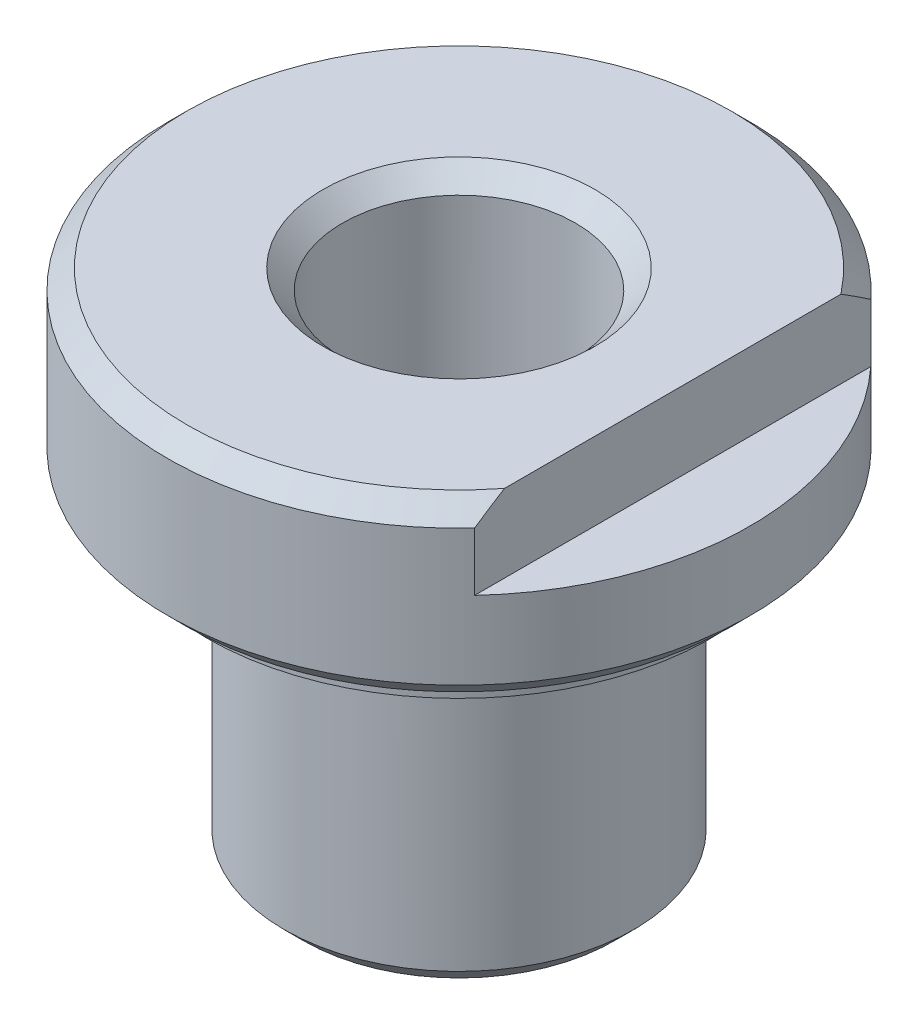
ISO-10303-21;
HEADER;
FILE_DESCRIPTION(('STEP AP214'),'2;1');
FILE_NAME('part.step','',(''),(''),'','','');
FILE_SCHEMA(('AUTOMOTIVE_DESIGN { 1 0 10303 214 1 1 1 1 }'));
ENDSEC;
DATA;
#1=APPLICATION_CONTEXT('core data for automotive mechanical design processes');
#2=APPLICATION_PROTOCOL_DEFINITION('international standard','automotive_design',2000,#1);
#3=PRODUCT_CONTEXT('',#1,'mechanical');
#4=PRODUCT('Part','Part','',(#3));
#5=PRODUCT_RELATED_PRODUCT_CATEGORY('part','',(#4));
#6=PRODUCT_DEFINITION_FORMATION('','',#4);
#7=PRODUCT_DEFINITION_CONTEXT('part definition',#1,'design');
#8=PRODUCT_DEFINITION('design','',#6,#7);
#9=PRODUCT_DEFINITION_SHAPE('','',#8);
#10=(LENGTH_UNIT() NAMED_UNIT(*) SI_UNIT(.MILLI.,.METRE.));
#11=(NAMED_UNIT(*) PLANE_ANGLE_UNIT() SI_UNIT($,.RADIAN.));
#12=(NAMED_UNIT(*) SI_UNIT($,.STERADIAN.) SOLID_ANGLE_UNIT());
#13=UNCERTAINTY_MEASURE_WITH_UNIT(LENGTH_MEASURE(1.E-05),#10,'distance_accuracy_value','');
#14=(GEOMETRIC_REPRESENTATION_CONTEXT(3) GLOBAL_UNCERTAINTY_ASSIGNED_CONTEXT((#13)) GLOBAL_UNIT_ASSIGNED_CONTEXT((#10,
#11,#12)) REPRESENTATION_CONTEXT('',''));
#15=CARTESIAN_POINT('',(0.,0.,0.));
#16=DIRECTION('',(0.,0.,1.));
#17=DIRECTION('',(1.,0.,0.));
#18=AXIS2_PLACEMENT_3D('',#15,#16,#17);
#19=CARTESIAN_POINT('',(0.,26.,0.));
#20=DIRECTION('',(0.,1.,0.));
#21=DIRECTION('',(0.,0.,1.));
#22=AXIS2_PLACEMENT_3D('',#19,#20,#21);
#23=CYLINDRICAL_SURFACE('',#22,8.);
#24=CARTESIAN_POINT('',(0.,16.5,0.));
#25=DIRECTION('',(0.,1.,0.));
#26=DIRECTION('',(0.,0.,1.));
#27=AXIS2_PLACEMENT_3D('',#24,#25,#26);
#28=CIRCLE('',#27,8.);
#29=CARTESIAN_POINT('',(0.,16.5,8.));
#30=VERTEX_POINT('',#29);
#31=EDGE_CURVE('E85',#30,#30,#28,.T.);
#32=ORIENTED_EDGE('',*,*,#31,.F.);
#33=EDGE_LOOP('',(#32));
#34=FACE_BOUND('',#33,.T.);
#35=CARTESIAN_POINT('',(0.,15.,0.));
#36=DIRECTION('',(0.,1.,0.));
#37=DIRECTION('',(0.,0.,1.));
#38=AXIS2_PLACEMENT_3D('',#35,#36,#37);
#39=CIRCLE('',#38,8.);
#40=CARTESIAN_POINT('',(0.,15.,8.));
#41=VERTEX_POINT('',#40);
#42=EDGE_CURVE('E91',#41,#41,#39,.T.);
#43=ORIENTED_EDGE('',*,*,#42,.T.);
#44=EDGE_LOOP('',(#43));
#45=FACE_BOUND('',#44,.T.);
#46=ADVANCED_FACE('F36',(#34,#45),#23,.T.);
#47=CARTESIAN_POINT('',(0.,16.5,0.));
#48=DIRECTION('',(0.,1.,0.));
#49=DIRECTION('',(0.,0.,1.));
#50=AXIS2_PLACEMENT_3D('',#47,#48,#49);
#51=PLANE('',#50);
#52=CARTESIAN_POINT('',(0.,16.5,0.));
#53=DIRECTION('',(0.,1.,0.));
#54=DIRECTION('',(0.,0.,1.));
#55=AXIS2_PLACEMENT_3D('',#52,#53,#54);
#56=CIRCLE('',#55,10.);
#57=CARTESIAN_POINT('',(0.,16.5,10.));
#58=VERTEX_POINT('',#57);
#59=EDGE_CURVE('E103',#58,#58,#56,.T.);
#60=ORIENTED_EDGE('',*,*,#59,.F.);
#61=EDGE_LOOP('',(#60));
#62=FACE_BOUND('',#61,.T.);
#63=ORIENTED_EDGE('',*,*,#31,.T.);
#64=EDGE_LOOP('',(#63));
#65=FACE_BOUND('',#64,.T.);
#66=ADVANCED_FACE('F157',(#62,#65),#51,.F.);
#67=CARTESIAN_POINT('',(0.,15.,0.));
#68=DIRECTION('',(0.,-1.,0.));
#69=DIRECTION('',(0.,0.,-1.));
#70=AXIS2_PLACEMENT_3D('',#67,#68,#69);
#71=PLANE('',#70);
#72=CARTESIAN_POINT('',(0.,15.,0.));
#73=DIRECTION('',(0.,-1.,0.));
#74=DIRECTION('',(0.,0.,-1.));
#75=AXIS2_PLACEMENT_3D('',#72,#73,#74);
#76=CIRCLE('',#75,8.5);
#77=CARTESIAN_POINT('',(0.,15.,-8.5));
#78=VERTEX_POINT('',#77);
#79=EDGE_CURVE('E223',#78,#78,#76,.F.);
#80=ORIENTED_EDGE('',*,*,#79,.T.);
#81=EDGE_LOOP('',(#80));
#82=FACE_BOUND('',#81,.T.);
#83=ORIENTED_EDGE('',*,*,#42,.F.);
#84=EDGE_LOOP('',(#83));
#85=FACE_BOUND('',#84,.T.);
#86=ADVANCED_FACE('F159',(#82,#85),#71,.F.);
#87=CARTESIAN_POINT('',(0.,26.,0.));
#88=DIRECTION('',(0.,1.,0.));
#89=DIRECTION('',(0.,0.,1.));
#90=AXIS2_PLACEMENT_3D('',#87,#88,#89);
#91=CYLINDRICAL_SURFACE('',#90,9.);
#92=CARTESIAN_POINT('',(0.,14.5,0.));
#93=DIRECTION('',(0.,-1.,0.));
#94=DIRECTION('',(0.,0.,-1.));
#95=AXIS2_PLACEMENT_3D('',#92,#93,#94);
#96=CIRCLE('',#95,9.);
#97=CARTESIAN_POINT('',(0.,14.5,-9.));
#98=VERTEX_POINT('',#97);
#99=EDGE_CURVE('E225',#98,#98,#96,.T.);
#100=ORIENTED_EDGE('',*,*,#99,.T.);
#101=EDGE_LOOP('',(#100));
#102=FACE_BOUND('',#101,.T.);
#103=CARTESIAN_POINT('',(0.,1.00000000000001,0.));
#104=DIRECTION('',(0.,1.,0.));
#105=DIRECTION('',(0.,0.,1.));
#106=AXIS2_PLACEMENT_3D('',#103,#104,#105);
#107=CIRCLE('',#106,9.);
#108=CARTESIAN_POINT('',(0.,1.00000000000001,9.));
#109=VERTEX_POINT('',#108);
#110=EDGE_CURVE('E115',#109,#109,#107,.T.);
#111=ORIENTED_EDGE('',*,*,#110,.T.);
#112=EDGE_LOOP('',(#111));
#113=FACE_BOUND('',#112,.T.);
#114=ADVANCED_FACE('F162',(#102,#113),#91,.T.);
#115=CARTESIAN_POINT('',(0.,0.,0.));
#116=DIRECTION('',(0.,1.,0.));
#117=DIRECTION('',(0.,0.,1.));
#118=AXIS2_PLACEMENT_3D('',#115,#116,#117);
#119=PLANE('',#118);
#120=CARTESIAN_POINT('',(0.,0.,0.));
#121=DIRECTION('',(0.,1.,0.));
#122=DIRECTION('',(0.,0.,1.));
#123=AXIS2_PLACEMENT_3D('',#120,#121,#122);
#124=CIRCLE('',#123,6.5);
#125=CARTESIAN_POINT('',(0.,0.,6.5));
#126=VERTEX_POINT('',#125);
#127=EDGE_CURVE('E11',#126,#126,#124,.T.);
#128=ORIENTED_EDGE('',*,*,#127,.T.);
#129=EDGE_LOOP('',(#128));
#130=FACE_BOUND('',#129,.T.);
#131=CARTESIAN_POINT('',(0.,0.,0.));
#132=DIRECTION('',(0.,1.,0.));
#133=DIRECTION('',(0.,0.,1.));
#134=AXIS2_PLACEMENT_3D('',#131,#132,#133);
#135=CIRCLE('',#134,7.99999999999998);
#136=CARTESIAN_POINT('',(0.,0.,7.99999999999998));
#137=VERTEX_POINT('',#136);
#138=EDGE_CURVE('E118',#137,#137,#135,.F.);
#139=ORIENTED_EDGE('',*,*,#138,.T.);
#140=EDGE_LOOP('',(#139));
#141=FACE_BOUND('',#140,.T.);
#142=ADVANCED_FACE('F154',(#130,#141),#119,.F.);
#143=CARTESIAN_POINT('',(0.,26.,0.));
#144=DIRECTION('',(0.,1.,0.));
#145=DIRECTION('',(0.,0.,1.));
#146=AXIS2_PLACEMENT_3D('',#143,#144,#145);
#147=CYLINDRICAL_SURFACE('',#146,15.);
#148=CARTESIAN_POINT('',(0.,18.,0.));
#149=DIRECTION('',(0.,-1.,0.));
#150=DIRECTION('',(0.,0.,-1.));
#151=AXIS2_PLACEMENT_3D('',#148,#149,#150);
#152=CIRCLE('',#151,15.);
#153=CARTESIAN_POINT('',(0.,18.,-15.));
#154=VERTEX_POINT('',#153);
#155=EDGE_CURVE('E122',#154,#154,#152,.F.);
#156=ORIENTED_EDGE('',*,*,#155,.T.);
#157=EDGE_LOOP('',(#156));
#158=FACE_BOUND('',#157,.T.);
#159=DIRECTION('',(0.,1.,0.));
#160=VECTOR('',#159,1.);
#161=CARTESIAN_POINT('',(11.,22.,10.1980390271856));
#162=LINE('',#161,#160);
#163=CARTESIAN_POINT('',(11.,22.,10.1980390271856));
#164=VERTEX_POINT('',#163);
#165=CARTESIAN_POINT('',(11.,25.,10.1980390271856));
#166=VERTEX_POINT('',#165);
#167=EDGE_CURVE('E81',#164,#166,#162,.T.);
#168=ORIENTED_EDGE('',*,*,#167,.T.);
#169=CARTESIAN_POINT('',(0.,25.,0.));
#170=DIRECTION('',(0.,-1.,0.));
#171=DIRECTION('',(0.,0.,-1.));
#172=AXIS2_PLACEMENT_3D('',#169,#170,#171);
#173=CIRCLE('',#172,15.);
#174=CARTESIAN_POINT('',(11.,25.,-10.1980390271856));
#175=VERTEX_POINT('',#174);
#176=EDGE_CURVE('E51',#166,#175,#173,.T.);
#177=ORIENTED_EDGE('',*,*,#176,.T.);
#178=DIRECTION('',(0.,1.,0.));
#179=VECTOR('',#178,1.);
#180=CARTESIAN_POINT('',(11.,22.,-10.1980390271856));
#181=LINE('',#180,#179);
#182=CARTESIAN_POINT('',(11.,22.,-10.1980390271856));
#183=VERTEX_POINT('',#182);
#184=EDGE_CURVE('E79',#183,#175,#181,.T.);
#185=ORIENTED_EDGE('',*,*,#184,.F.);
#186=CARTESIAN_POINT('',(0.,22.,0.));
#187=DIRECTION('',(0.,1.,0.));
#188=DIRECTION('',(0.,0.,1.));
#189=AXIS2_PLACEMENT_3D('',#186,#187,#188);
#190=CIRCLE('',#189,15.);
#191=EDGE_CURVE('E72',#164,#183,#190,.T.);
#192=ORIENTED_EDGE('',*,*,#191,.F.);
#193=EDGE_LOOP('',(#168,#177,#185,#192));
#194=FACE_BOUND('',#193,.T.);
#195=ADVANCED_FACE('F83',(#158,#194),#147,.T.);
#196=CARTESIAN_POINT('',(0.,26.,0.));
#197=DIRECTION('',(0.,-1.,0.));
#198=DIRECTION('',(0.,0.,-1.));
#199=AXIS2_PLACEMENT_3D('',#196,#197,#198);
#200=PLANE('',#199);
#201=CARTESIAN_POINT('',(0.,26.,0.));
#202=DIRECTION('',(0.,-1.,0.));
#203=DIRECTION('',(0.,0.,-1.));
#204=AXIS2_PLACEMENT_3D('',#201,#202,#203);
#205=CIRCLE('',#204,7.00000000000001);
#206=CARTESIAN_POINT('',(0.,26.,-7.00000000000001));
#207=VERTEX_POINT('',#206);
#208=EDGE_CURVE('E109',#207,#207,#205,.T.);
#209=ORIENTED_EDGE('',*,*,#208,.T.);
#210=EDGE_LOOP('',(#209));
#211=FACE_BOUND('',#210,.T.);
#212=DIRECTION('',(0.,0.,1.));
#213=VECTOR('',#212,1.);
#214=CARTESIAN_POINT('',(11.,26.,-10.1980390271856));
#215=LINE('',#214,#213);
#216=CARTESIAN_POINT('',(11.,26.,-8.66025403784439));
#217=VERTEX_POINT('',#216);
#218=CARTESIAN_POINT('',(11.,26.,8.66025403784438));
#219=VERTEX_POINT('',#218);
#220=EDGE_CURVE('E76',#217,#219,#215,.T.);
#221=ORIENTED_EDGE('',*,*,#220,.F.);
#222=CARTESIAN_POINT('',(0.,26.,0.));
#223=DIRECTION('',(0.,-1.,0.));
#224=DIRECTION('',(0.,0.,-1.));
#225=AXIS2_PLACEMENT_3D('',#222,#223,#224);
#226=CIRCLE('',#225,14.);
#227=EDGE_CURVE('E106',#217,#219,#226,.F.);
#228=ORIENTED_EDGE('',*,*,#227,.T.);
#229=EDGE_LOOP('',(#221,#228));
#230=FACE_BOUND('',#229,.T.);
#231=ADVANCED_FACE('F170',(#211,#230),#200,.F.);
#232=CARTESIAN_POINT('',(0.,17.,0.));
#233=DIRECTION('',(0.,-1.,0.));
#234=DIRECTION('',(0.,0.,-1.));
#235=AXIS2_PLACEMENT_3D('',#232,#233,#234);
#236=PLANE('',#235);
#237=CARTESIAN_POINT('',(0.,17.,0.));
#238=DIRECTION('',(0.,-1.,0.));
#239=DIRECTION('',(0.,0.,-1.));
#240=AXIS2_PLACEMENT_3D('',#237,#238,#239);
#241=CIRCLE('',#240,14.);
#242=CARTESIAN_POINT('',(0.,17.,-14.));
#243=VERTEX_POINT('',#242);
#244=EDGE_CURVE('E125',#243,#243,#241,.T.);
#245=ORIENTED_EDGE('',*,*,#244,.T.);
#246=EDGE_LOOP('',(#245));
#247=FACE_BOUND('',#246,.T.);
#248=CARTESIAN_POINT('',(0.,17.,0.));
#249=DIRECTION('',(0.,1.,0.));
#250=DIRECTION('',(0.,0.,1.));
#251=AXIS2_PLACEMENT_3D('',#248,#249,#250);
#252=CIRCLE('',#251,13.);
#253=CARTESIAN_POINT('',(0.,17.,13.));
#254=VERTEX_POINT('',#253);
#255=EDGE_CURVE('E94',#254,#254,#252,.T.);
#256=ORIENTED_EDGE('',*,*,#255,.T.);
#257=EDGE_LOOP('',(#256));
#258=FACE_BOUND('',#257,.T.);
#259=ADVANCED_FACE('F173',(#247,#258),#236,.T.);
#260=CARTESIAN_POINT('',(0.,26.,0.));
#261=DIRECTION('',(0.,1.,0.));
#262=DIRECTION('',(0.,0.,1.));
#263=AXIS2_PLACEMENT_3D('',#260,#261,#262);
#264=CYLINDRICAL_SURFACE('',#263,13.);
#265=CARTESIAN_POINT('',(0.,16.,0.));
#266=DIRECTION('',(0.,1.,0.));
#267=DIRECTION('',(0.,0.,1.));
#268=AXIS2_PLACEMENT_3D('',#265,#266,#267);
#269=CIRCLE('',#268,13.);
#270=CARTESIAN_POINT('',(0.,16.,13.));
#271=VERTEX_POINT('',#270);
#272=EDGE_CURVE('E97',#271,#271,#269,.T.);
#273=ORIENTED_EDGE('',*,*,#272,.T.);
#274=EDGE_LOOP('',(#273));
#275=FACE_BOUND('',#274,.T.);
#276=ORIENTED_EDGE('',*,*,#255,.F.);
#277=EDGE_LOOP('',(#276));
#278=FACE_BOUND('',#277,.T.);
#279=ADVANCED_FACE('F180',(#275,#278),#264,.T.);
#280=CARTESIAN_POINT('',(0.,16.,0.));
#281=DIRECTION('',(0.,1.,0.));
#282=DIRECTION('',(0.,0.,1.));
#283=AXIS2_PLACEMENT_3D('',#280,#281,#282);
#284=PLANE('',#283);
#285=ORIENTED_EDGE('',*,*,#272,.F.);
#286=EDGE_LOOP('',(#285));
#287=FACE_BOUND('',#286,.T.);
#288=CARTESIAN_POINT('',(0.,16.,0.));
#289=DIRECTION('',(0.,1.,0.));
#290=DIRECTION('',(0.,0.,1.));
#291=AXIS2_PLACEMENT_3D('',#288,#289,#290);
#292=CIRCLE('',#291,10.);
#293=CARTESIAN_POINT('',(0.,16.,10.));
#294=VERTEX_POINT('',#293);
#295=EDGE_CURVE('E100',#294,#294,#292,.T.);
#296=ORIENTED_EDGE('',*,*,#295,.T.);
#297=EDGE_LOOP('',(#296));
#298=FACE_BOUND('',#297,.T.);
#299=ADVANCED_FACE('F184',(#287,#298),#284,.F.);
#300=CARTESIAN_POINT('',(0.,26.,0.));
#301=DIRECTION('',(0.,1.,0.));
#302=DIRECTION('',(0.,0.,1.));
#303=AXIS2_PLACEMENT_3D('',#300,#301,#302);
#304=CYLINDRICAL_SURFACE('',#303,10.);
#305=ORIENTED_EDGE('',*,*,#295,.F.);
#306=EDGE_LOOP('',(#305));
#307=FACE_BOUND('',#306,.T.);
#308=ORIENTED_EDGE('',*,*,#59,.T.);
#309=EDGE_LOOP('',(#308));
#310=FACE_BOUND('',#309,.T.);
#311=ADVANCED_FACE('F152',(#307,#310),#304,.F.);
#312=CARTESIAN_POINT('',(0.,26.,0.));
#313=DIRECTION('',(0.,-1.,0.));
#314=DIRECTION('',(0.,0.,-1.));
#315=AXIS2_PLACEMENT_3D('',#312,#313,#314);
#316=CYLINDRICAL_SURFACE('',#315,6.);
#317=CARTESIAN_POINT('',(0.,0.5,0.));
#318=DIRECTION('',(0.,1.,0.));
#319=DIRECTION('',(0.,0.,1.));
#320=AXIS2_PLACEMENT_3D('',#317,#318,#319);
#321=CIRCLE('',#320,6.);
#322=CARTESIAN_POINT('',(0.,0.5,6.));
#323=VERTEX_POINT('',#322);
#324=EDGE_CURVE('E44',#323,#323,#321,.F.);
#325=ORIENTED_EDGE('',*,*,#324,.T.);
#326=EDGE_LOOP('',(#325));
#327=FACE_BOUND('',#326,.T.);
#328=CARTESIAN_POINT('',(0.,25.,0.));
#329=DIRECTION('',(0.,-1.,0.));
#330=DIRECTION('',(0.,0.,-1.));
#331=AXIS2_PLACEMENT_3D('',#328,#329,#330);
#332=CIRCLE('',#331,6.);
#333=CARTESIAN_POINT('',(0.,25.,-6.));
#334=VERTEX_POINT('',#333);
#335=EDGE_CURVE('E112',#334,#334,#332,.F.);
#336=ORIENTED_EDGE('',*,*,#335,.T.);
#337=EDGE_LOOP('',(#336));
#338=FACE_BOUND('',#337,.T.);
#339=ADVANCED_FACE('F148',(#327,#338),#316,.F.);
#340=CARTESIAN_POINT('',(11.,22.,-10.1980390271856));
#341=DIRECTION('',(-1.,0.,0.));
#342=DIRECTION('',(0.,0.,1.));
#343=AXIS2_PLACEMENT_3D('',#340,#341,#342);
#344=PLANE('',#343);
#345=ORIENTED_EDGE('',*,*,#220,.T.);
#346=CARTESIAN_POINT('',(11.,26.,8.66025403784438));
#347=CARTESIAN_POINT('',(11.,25.9195703536757,8.79027144318522));
#348=CARTESIAN_POINT('',(11.,25.8383361007494,8.91978924484244));
#349=CARTESIAN_POINT('',(11.,25.6743858458112,9.17786283805277));
#350=CARTESIAN_POINT('',(11.,25.591670016424,9.30641873923804));
#351=CARTESIAN_POINT('',(11.,25.4248664125517,9.56263424634969));
#352=CARTESIAN_POINT('',(11.,25.3407786548004,9.69029386318122));
#353=CARTESIAN_POINT('',(11.,25.1713222713732,9.94478168559514));
#354=CARTESIAN_POINT('',(11.,25.0859534985509,10.0716097932226));
#355=CARTESIAN_POINT('',(11.,25.,10.1980390271856));
#356=B_SPLINE_CURVE_WITH_KNOTS('',3,(#346,#347,#348,#349,#350,#351,#352,#353,#354,#355),
.UNSPECIFIED.,.F.,.F.,(4,2,2,2,4),(0.,0.458646153912246,0.91723921225931,1.37582668116352,
1.83446723618275),.UNSPECIFIED.);
#357=EDGE_CURVE('E59',#219,#166,#356,.T.);
#358=ORIENTED_EDGE('',*,*,#357,.T.);
#359=ORIENTED_EDGE('',*,*,#167,.F.);
#360=DIRECTION('',(0.,0.,1.));
#361=VECTOR('',#360,1.);
#362=CARTESIAN_POINT('',(11.,22.,-10.1980390271856));
#363=LINE('',#362,#361);
#364=EDGE_CURVE('E75',#183,#164,#363,.T.);
#365=ORIENTED_EDGE('',*,*,#364,.F.);
#366=ORIENTED_EDGE('',*,*,#184,.T.);
#367=CARTESIAN_POINT('',(11.,25.,-10.1980390271856));
#368=CARTESIAN_POINT('',(11.,25.0859534985509,-10.0716097932226));
#369=CARTESIAN_POINT('',(11.,25.1713222713732,-9.94478168559514));
#370=CARTESIAN_POINT('',(11.,25.3407786548004,-9.69029386318123));
#371=CARTESIAN_POINT('',(11.,25.4248664125517,-9.56263424634969));
#372=CARTESIAN_POINT('',(11.,25.591670016424,-9.30641873923805));
#373=CARTESIAN_POINT('',(11.,25.6743858458112,-9.17786283805277));
#374=CARTESIAN_POINT('',(11.,25.8383361007494,-8.91978924484244));
#375=CARTESIAN_POINT('',(11.,25.9195703536757,-8.79027144318522));
#376=CARTESIAN_POINT('',(11.,26.,-8.66025403784439));
#377=B_SPLINE_CURVE_WITH_KNOTS('',3,(#367,#368,#369,#370,#371,#372,#373,#374,#375,#376),
.UNSPECIFIED.,.F.,.F.,(4,2,2,2,4),(0.,0.458640555019231,0.917228023923435,1.3758210822705,
1.83446723618275),.UNSPECIFIED.);
#378=EDGE_CURVE('E128',#175,#217,#377,.T.);
#379=ORIENTED_EDGE('',*,*,#378,.T.);
#380=EDGE_LOOP('',(#345,#358,#359,#365,#366,#379));
#381=FACE_BOUND('',#380,.T.);
#382=ADVANCED_FACE('F78',(#381),#344,.F.);
#383=CARTESIAN_POINT('',(0.,22.,0.));
#384=DIRECTION('',(0.,1.,0.));
#385=DIRECTION('',(0.,0.,1.));
#386=AXIS2_PLACEMENT_3D('',#383,#384,#385);
#387=PLANE('',#386);
#388=ORIENTED_EDGE('',*,*,#191,.T.);
#389=ORIENTED_EDGE('',*,*,#364,.T.);
#390=EDGE_LOOP('',(#388,#389));
#391=FACE_BOUND('',#390,.T.);
#392=ADVANCED_FACE('F74',(#391),#387,.T.);
#393=CARTESIAN_POINT('',(0.,26.,0.));
#394=DIRECTION('',(0.,1.,0.));
#395=DIRECTION('',(0.,0.,1.));
#396=AXIS2_PLACEMENT_3D('',#393,#394,#395);
#397=CONICAL_SURFACE('',#396,7.00000000000001,0.785398163397447);
#398=ORIENTED_EDGE('',*,*,#335,.F.);
#399=EDGE_LOOP('',(#398));
#400=FACE_BOUND('',#399,.T.);
#401=ORIENTED_EDGE('',*,*,#208,.F.);
#402=EDGE_LOOP('',(#401));
#403=FACE_BOUND('',#402,.T.);
#404=ADVANCED_FACE('F195',(#400,#403),#397,.F.);
#405=CARTESIAN_POINT('',(0.,1.00000000000001,0.));
#406=DIRECTION('',(0.,1.,0.));
#407=DIRECTION('',(0.,0.,1.));
#408=AXIS2_PLACEMENT_3D('',#405,#406,#407);
#409=CONICAL_SURFACE('',#408,9.,0.785398163397453);
#410=ORIENTED_EDGE('',*,*,#138,.F.);
#411=EDGE_LOOP('',(#410));
#412=FACE_BOUND('',#411,.T.);
#413=ORIENTED_EDGE('',*,*,#110,.F.);
#414=EDGE_LOOP('',(#413));
#415=FACE_BOUND('',#414,.T.);
#416=ADVANCED_FACE('F198',(#412,#415),#409,.T.);
#417=CARTESIAN_POINT('',(0.,18.,0.));
#418=DIRECTION('',(0.,1.,0.));
#419=DIRECTION('',(0.,0.,1.));
#420=AXIS2_PLACEMENT_3D('',#417,#418,#419);
#421=CONICAL_SURFACE('',#420,15.,0.785398163397447);
#422=ORIENTED_EDGE('',*,*,#244,.F.);
#423=EDGE_LOOP('',(#422));
#424=FACE_BOUND('',#423,.T.);
#425=ORIENTED_EDGE('',*,*,#155,.F.);
#426=EDGE_LOOP('',(#425));
#427=FACE_BOUND('',#426,.T.);
#428=ADVANCED_FACE('F201',(#424,#427),#421,.T.);
#429=CARTESIAN_POINT('',(0.,26.,0.));
#430=DIRECTION('',(0.,-1.,0.));
#431=DIRECTION('',(0.,0.,-1.));
#432=AXIS2_PLACEMENT_3D('',#429,#430,#431);
#433=CONICAL_SURFACE('',#432,14.,0.785398163397447);
#434=ORIENTED_EDGE('',*,*,#378,.F.);
#435=ORIENTED_EDGE('',*,*,#176,.F.);
#436=ORIENTED_EDGE('',*,*,#357,.F.);
#437=ORIENTED_EDGE('',*,*,#227,.F.);
#438=EDGE_LOOP('',(#434,#435,#436,#437));
#439=FACE_BOUND('',#438,.T.);
#440=ADVANCED_FACE('F141',(#439),#433,.T.);
#441=CARTESIAN_POINT('',(0.,15.,0.));
#442=DIRECTION('',(0.,-1.,0.));
#443=DIRECTION('',(0.,0.,-1.));
#444=AXIS2_PLACEMENT_3D('',#441,#442,#443);
#445=CONICAL_SURFACE('',#444,8.5,0.785398163397445);
#446=ORIENTED_EDGE('',*,*,#99,.F.);
#447=EDGE_LOOP('',(#446));
#448=FACE_BOUND('',#447,.T.);
#449=ORIENTED_EDGE('',*,*,#79,.F.);
#450=EDGE_LOOP('',(#449));
#451=FACE_BOUND('',#450,.T.);
#452=ADVANCED_FACE('F208',(#448,#451),#445,.T.);
#453=CARTESIAN_POINT('',(0.,0.5,0.));
#454=DIRECTION('',(0.,-1.,0.));
#455=DIRECTION('',(0.,0.,-1.));
#456=AXIS2_PLACEMENT_3D('',#453,#454,#455);
#457=CONICAL_SURFACE('',#456,6.,0.785398163397447);
#458=ORIENTED_EDGE('',*,*,#127,.F.);
#459=EDGE_LOOP('',(#458));
#460=FACE_BOUND('',#459,.T.);
#461=ORIENTED_EDGE('',*,*,#324,.F.);
#462=EDGE_LOOP('',(#461));
#463=FACE_BOUND('',#462,.T.);
#464=ADVANCED_FACE('F38',(#460,#463),#457,.F.);
#465=CLOSED_SHELL('',(#46,#66,#86,#114,#142,#195,#231,#259,#279,#299,#311,#339,#382,#392,#404,
#416,#428,#440,#452,#464));
#466=MANIFOLD_SOLID_BREP('B2',#465);
#467=ADVANCED_BREP_SHAPE_REPRESENTATION('',(#18,#466),#14);
#468=SHAPE_DEFINITION_REPRESENTATION(#9,#467);
ENDSEC;
END-ISO-10303-21;
